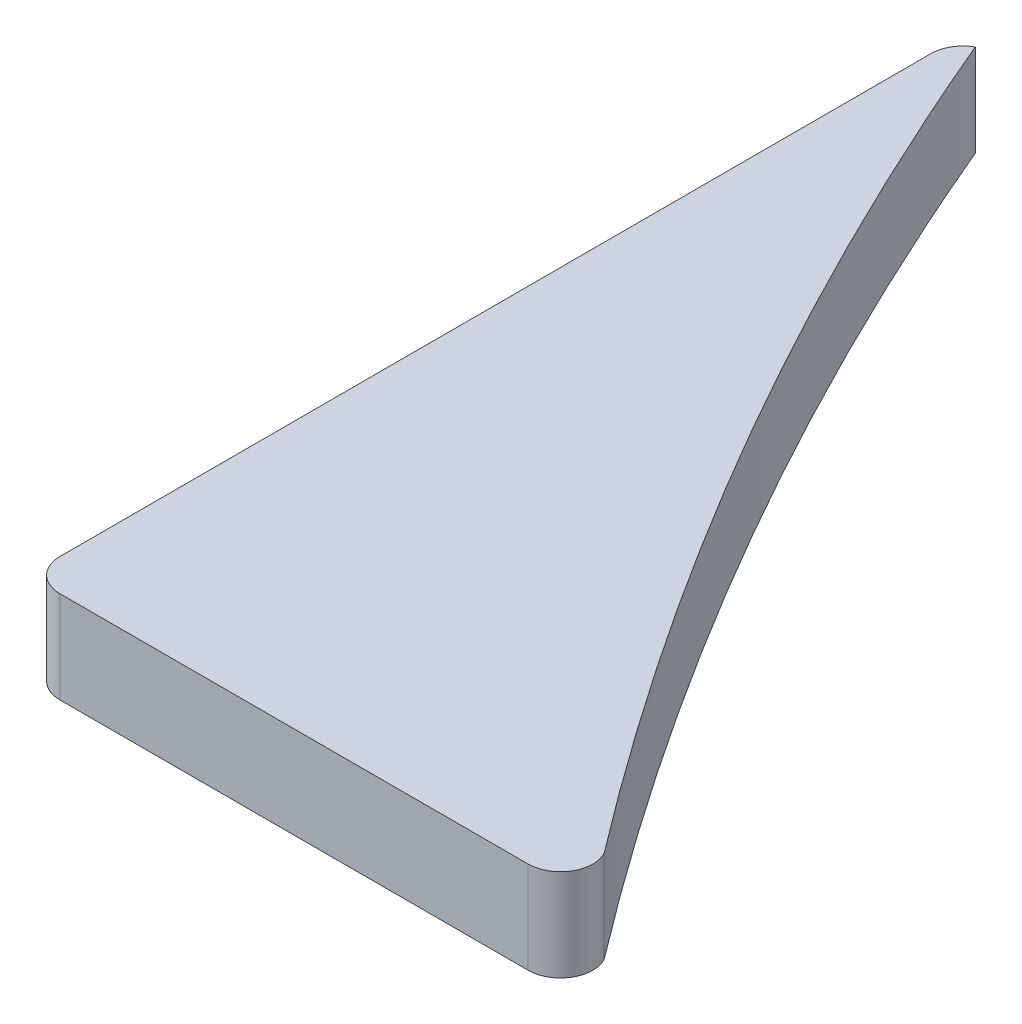
ISO-10303-21;
HEADER;
FILE_DESCRIPTION(('STEP AP214'),'2;1');
FILE_NAME('part.step','',(''),(''),'','','');
FILE_SCHEMA(('AUTOMOTIVE_DESIGN { 1 0 10303 214 1 1 1 1 }'));
ENDSEC;
DATA;
#1=APPLICATION_CONTEXT('core data for automotive mechanical design processes');
#2=APPLICATION_PROTOCOL_DEFINITION('international standard','automotive_design',2000,#1);
#3=PRODUCT_CONTEXT('',#1,'mechanical');
#4=PRODUCT('Part','Part','',(#3));
#5=PRODUCT_RELATED_PRODUCT_CATEGORY('part','',(#4));
#6=PRODUCT_DEFINITION_FORMATION('','',#4);
#7=PRODUCT_DEFINITION_CONTEXT('part definition',#1,'design');
#8=PRODUCT_DEFINITION('design','',#6,#7);
#9=PRODUCT_DEFINITION_SHAPE('','',#8);
#10=(LENGTH_UNIT() NAMED_UNIT(*) SI_UNIT(.MILLI.,.METRE.));
#11=(NAMED_UNIT(*) PLANE_ANGLE_UNIT() SI_UNIT($,.RADIAN.));
#12=(NAMED_UNIT(*) SI_UNIT($,.STERADIAN.) SOLID_ANGLE_UNIT());
#13=UNCERTAINTY_MEASURE_WITH_UNIT(LENGTH_MEASURE(1.E-05),#10,'distance_accuracy_value','');
#14=(GEOMETRIC_REPRESENTATION_CONTEXT(3) GLOBAL_UNCERTAINTY_ASSIGNED_CONTEXT((#13)) GLOBAL_UNIT_ASSIGNED_CONTEXT((#10,
#11,#12)) REPRESENTATION_CONTEXT('',''));
#15=CARTESIAN_POINT('',(0.,0.,0.));
#16=DIRECTION('',(0.,0.,1.));
#17=DIRECTION('',(1.,0.,0.));
#18=AXIS2_PLACEMENT_3D('',#15,#16,#17);
#19=CARTESIAN_POINT('',(2.,5.7,-2.));
#20=DIRECTION('',(0.,-1.,0.));
#21=DIRECTION('',(0.,0.,-1.));
#22=AXIS2_PLACEMENT_3D('',#19,#20,#21);
#23=CYLINDRICAL_SURFACE('',#22,2.);
#24=CARTESIAN_POINT('',(2.,0.,-2.));
#25=DIRECTION('',(0.,1.,0.));
#26=DIRECTION('',(0.,0.,1.));
#27=AXIS2_PLACEMENT_3D('',#24,#25,#26);
#28=CIRCLE('',#27,2.);
#29=CARTESIAN_POINT('',(0.,0.,-2.00000000000001));
#30=VERTEX_POINT('',#29);
#31=CARTESIAN_POINT('',(2.00000000000001,0.,0.));
#32=VERTEX_POINT('',#31);
#33=EDGE_CURVE('E135',#30,#32,#28,.T.);
#34=ORIENTED_EDGE('',*,*,#33,.T.);
#35=DIRECTION('',(0.,-1.,0.));
#36=VECTOR('',#35,1.);
#37=CARTESIAN_POINT('',(2.00000000000001,5.7,0.));
#38=LINE('',#37,#36);
#39=CARTESIAN_POINT('',(2.00000000000001,5.7,0.));
#40=VERTEX_POINT('',#39);
#41=EDGE_CURVE('E11',#40,#32,#38,.T.);
#42=ORIENTED_EDGE('',*,*,#41,.F.);
#43=CARTESIAN_POINT('',(2.,5.7,-2.));
#44=DIRECTION('',(0.,1.,0.));
#45=DIRECTION('',(0.,0.,1.));
#46=AXIS2_PLACEMENT_3D('',#43,#44,#45);
#47=CIRCLE('',#46,2.);
#48=CARTESIAN_POINT('',(0.,5.7,-2.00000000000001));
#49=VERTEX_POINT('',#48);
#50=EDGE_CURVE('E156',#49,#40,#47,.T.);
#51=ORIENTED_EDGE('',*,*,#50,.F.);
#52=DIRECTION('',(0.,-1.,0.));
#53=VECTOR('',#52,1.);
#54=CARTESIAN_POINT('',(0.,5.7,-2.00000000000001));
#55=LINE('',#54,#53);
#56=EDGE_CURVE('E128',#49,#30,#55,.T.);
#57=ORIENTED_EDGE('',*,*,#56,.T.);
#58=EDGE_LOOP('',(#34,#42,#51,#57));
#59=FACE_BOUND('',#58,.T.);
#60=ADVANCED_FACE('F43',(#59),#23,.T.);
#61=CARTESIAN_POINT('',(31.,5.7,0.));
#62=DIRECTION('',(0.,0.,-1.));
#63=DIRECTION('',(-1.,0.,0.));
#64=AXIS2_PLACEMENT_3D('',#61,#62,#63);
#65=PLANE('',#64);
#66=DIRECTION('',(1.,0.,0.));
#67=VECTOR('',#66,1.);
#68=CARTESIAN_POINT('',(31.,0.,0.));
#69=LINE('',#68,#67);
#70=CARTESIAN_POINT('',(31.,0.,0.));
#71=VERTEX_POINT('',#70);
#72=EDGE_CURVE('E139',#32,#71,#69,.T.);
#73=ORIENTED_EDGE('',*,*,#72,.T.);
#74=DIRECTION('',(0.,-1.,0.));
#75=VECTOR('',#74,1.);
#76=CARTESIAN_POINT('',(31.,5.7,0.));
#77=LINE('',#76,#75);
#78=CARTESIAN_POINT('',(31.,5.7,0.));
#79=VERTEX_POINT('',#78);
#80=EDGE_CURVE('E52',#79,#71,#77,.T.);
#81=ORIENTED_EDGE('',*,*,#80,.F.);
#82=DIRECTION('',(1.,0.,0.));
#83=VECTOR('',#82,1.);
#84=CARTESIAN_POINT('',(31.,5.7,0.));
#85=LINE('',#84,#83);
#86=EDGE_CURVE('E97',#40,#79,#85,.T.);
#87=ORIENTED_EDGE('',*,*,#86,.F.);
#88=ORIENTED_EDGE('',*,*,#41,.T.);
#89=EDGE_LOOP('',(#73,#81,#87,#88));
#90=FACE_BOUND('',#89,.T.);
#91=ADVANCED_FACE('F184',(#90),#65,.F.);
#92=CARTESIAN_POINT('',(31.,5.7,-2.));
#93=DIRECTION('',(0.,-1.,0.));
#94=DIRECTION('',(0.,0.,-1.));
#95=AXIS2_PLACEMENT_3D('',#92,#93,#94);
#96=CYLINDRICAL_SURFACE('',#95,2.);
#97=CARTESIAN_POINT('',(31.,0.,-2.));
#98=DIRECTION('',(0.,1.,0.));
#99=DIRECTION('',(0.,0.,-1.));
#100=AXIS2_PLACEMENT_3D('',#97,#98,#99);
#101=CIRCLE('',#100,2.);
#102=CARTESIAN_POINT('',(32.7621915755491,0.,-2.94587570592749));
#103=VERTEX_POINT('',#102);
#104=EDGE_CURVE('E142',#71,#103,#101,.T.);
#105=ORIENTED_EDGE('',*,*,#104,.T.);
#106=DIRECTION('',(0.,-1.,0.));
#107=VECTOR('',#106,1.);
#108=CARTESIAN_POINT('',(32.7621915755491,5.7,-2.94587570592749));
#109=LINE('',#108,#107);
#110=CARTESIAN_POINT('',(32.7621915755491,5.7,-2.94587570592749));
#111=VERTEX_POINT('',#110);
#112=EDGE_CURVE('E121',#111,#103,#109,.T.);
#113=ORIENTED_EDGE('',*,*,#112,.F.);
#114=CARTESIAN_POINT('',(31.,5.7,-2.));
#115=DIRECTION('',(0.,1.,0.));
#116=DIRECTION('',(0.,0.,-1.));
#117=AXIS2_PLACEMENT_3D('',#114,#115,#116);
#118=CIRCLE('',#117,2.);
#119=EDGE_CURVE('E110',#79,#111,#118,.T.);
#120=ORIENTED_EDGE('',*,*,#119,.F.);
#121=ORIENTED_EDGE('',*,*,#80,.T.);
#122=EDGE_LOOP('',(#105,#113,#120,#121));
#123=FACE_BOUND('',#122,.T.);
#124=ADVANCED_FACE('F166',(#123),#96,.T.);
#125=CARTESIAN_POINT('',(32.7621915755491,5.7,-2.94587570592749));
#126=CARTESIAN_POINT('',(13.3909370227549,5.7,-28.4129049767327));
#127=CARTESIAN_POINT('',(1.01618685192367,5.7,-57.6772810110356));
#128=B_SPLINE_CURVE_WITH_KNOTS('',2,(#125,#126,#127),.UNSPECIFIED.,.F.,.F.,(3,3),(0.,1.),.UNSPECIFIED.);
#129=DIRECTION('',(0.,-1.,0.));
#130=VECTOR('',#129,1.);
#131=SURFACE_OF_LINEAR_EXTRUSION('',#128,#130);
#132=CARTESIAN_POINT('',(32.7621915755491,0.,-2.94587570592749));
#133=CARTESIAN_POINT('',(13.3909370227549,0.,-28.4129049767327));
#134=CARTESIAN_POINT('',(1.01618685192367,0.,-57.6772810110356));
#135=B_SPLINE_CURVE_WITH_KNOTS('',2,(#132,#133,#134),.UNSPECIFIED.,.F.,.F.,(3,3),(0.,1.),.UNSPECIFIED.);
#136=CARTESIAN_POINT('',(1.01618685192367,0.,-57.6772810110356));
#137=VERTEX_POINT('',#136);
#138=EDGE_CURVE('E119',#103,#137,#135,.T.);
#139=ORIENTED_EDGE('',*,*,#138,.T.);
#140=DIRECTION('',(0.,-1.,0.));
#141=VECTOR('',#140,1.);
#142=CARTESIAN_POINT('',(1.01618685192367,5.7,-57.6772810110356));
#143=LINE('',#142,#141);
#144=CARTESIAN_POINT('',(1.01618685192367,5.7,-57.6772810110356));
#145=VERTEX_POINT('',#144);
#146=EDGE_CURVE('E116',#145,#137,#143,.T.);
#147=ORIENTED_EDGE('',*,*,#146,.F.);
#148=EDGE_CURVE('E104',#111,#145,#128,.T.);
#149=ORIENTED_EDGE('',*,*,#148,.F.);
#150=ORIENTED_EDGE('',*,*,#112,.T.);
#151=EDGE_LOOP('',(#139,#147,#149,#150));
#152=FACE_BOUND('',#151,.T.);
#153=ADVANCED_FACE('F117',(#152),#131,.F.);
#154=CARTESIAN_POINT('',(2.,5.7,-55.9359850311195));
#155=DIRECTION('',(0.,-1.,0.));
#156=DIRECTION('',(0.,0.,-1.));
#157=AXIS2_PLACEMENT_3D('',#154,#155,#156);
#158=CYLINDRICAL_SURFACE('',#157,2.);
#159=CARTESIAN_POINT('',(2.,0.,-55.9359850311195));
#160=DIRECTION('',(0.,1.,0.));
#161=DIRECTION('',(0.,0.,-1.));
#162=AXIS2_PLACEMENT_3D('',#159,#160,#161);
#163=CIRCLE('',#162,2.);
#164=CARTESIAN_POINT('',(0.,0.,-55.9359850311195));
#165=VERTEX_POINT('',#164);
#166=EDGE_CURVE('E83',#137,#165,#163,.T.);
#167=ORIENTED_EDGE('',*,*,#166,.T.);
#168=DIRECTION('',(0.,-1.,0.));
#169=VECTOR('',#168,1.);
#170=CARTESIAN_POINT('',(0.,5.7,-55.9359850311195));
#171=LINE('',#170,#169);
#172=CARTESIAN_POINT('',(0.,5.7,-55.9359850311195));
#173=VERTEX_POINT('',#172);
#174=EDGE_CURVE('E122',#173,#165,#171,.T.);
#175=ORIENTED_EDGE('',*,*,#174,.F.);
#176=CARTESIAN_POINT('',(2.,5.7,-55.9359850311195));
#177=DIRECTION('',(0.,1.,0.));
#178=DIRECTION('',(0.,0.,-1.));
#179=AXIS2_PLACEMENT_3D('',#176,#177,#178);
#180=CIRCLE('',#179,2.);
#181=EDGE_CURVE('E108',#145,#173,#180,.T.);
#182=ORIENTED_EDGE('',*,*,#181,.F.);
#183=ORIENTED_EDGE('',*,*,#146,.T.);
#184=EDGE_LOOP('',(#167,#175,#182,#183));
#185=FACE_BOUND('',#184,.T.);
#186=ADVANCED_FACE('F124',(#185),#158,.T.);
#187=CARTESIAN_POINT('',(0.,5.7,-2.00000000000001));
#188=DIRECTION('',(1.,0.,0.));
#189=DIRECTION('',(0.,0.,-1.));
#190=AXIS2_PLACEMENT_3D('',#187,#188,#189);
#191=PLANE('',#190);
#192=DIRECTION('',(0.,0.,1.));
#193=VECTOR('',#192,1.);
#194=CARTESIAN_POINT('',(0.,0.,-2.00000000000001));
#195=LINE('',#194,#193);
#196=EDGE_CURVE('E89',#165,#30,#195,.T.);
#197=ORIENTED_EDGE('',*,*,#196,.T.);
#198=ORIENTED_EDGE('',*,*,#56,.F.);
#199=DIRECTION('',(0.,0.,1.));
#200=VECTOR('',#199,1.);
#201=CARTESIAN_POINT('',(0.,5.7,-2.00000000000001));
#202=LINE('',#201,#200);
#203=EDGE_CURVE('E60',#173,#49,#202,.T.);
#204=ORIENTED_EDGE('',*,*,#203,.F.);
#205=ORIENTED_EDGE('',*,*,#174,.T.);
#206=EDGE_LOOP('',(#197,#198,#204,#205));
#207=FACE_BOUND('',#206,.T.);
#208=ADVANCED_FACE('F173',(#207),#191,.F.);
#209=CARTESIAN_POINT('',(2.,5.7,-2.));
#210=DIRECTION('',(0.,1.,0.));
#211=DIRECTION('',(0.,0.,1.));
#212=AXIS2_PLACEMENT_3D('',#209,#210,#211);
#213=PLANE('',#212);
#214=ORIENTED_EDGE('',*,*,#50,.T.);
#215=ORIENTED_EDGE('',*,*,#86,.T.);
#216=ORIENTED_EDGE('',*,*,#119,.T.);
#217=ORIENTED_EDGE('',*,*,#148,.T.);
#218=ORIENTED_EDGE('',*,*,#181,.T.);
#219=ORIENTED_EDGE('',*,*,#203,.T.);
#220=EDGE_LOOP('',(#214,#215,#216,#217,#218,#219));
#221=FACE_BOUND('',#220,.T.);
#222=ADVANCED_FACE('F106',(#221),#213,.T.);
#223=CARTESIAN_POINT('',(2.,0.,-2.));
#224=DIRECTION('',(0.,1.,0.));
#225=DIRECTION('',(0.,0.,1.));
#226=AXIS2_PLACEMENT_3D('',#223,#224,#225);
#227=PLANE('',#226);
#228=ORIENTED_EDGE('',*,*,#33,.F.);
#229=ORIENTED_EDGE('',*,*,#196,.F.);
#230=ORIENTED_EDGE('',*,*,#166,.F.);
#231=ORIENTED_EDGE('',*,*,#138,.F.);
#232=ORIENTED_EDGE('',*,*,#104,.F.);
#233=ORIENTED_EDGE('',*,*,#72,.F.);
#234=EDGE_LOOP('',(#228,#229,#230,#231,#232,#233));
#235=FACE_BOUND('',#234,.T.);
#236=ADVANCED_FACE('F169',(#235),#227,.F.);
#237=CLOSED_SHELL('',(#60,#91,#124,#153,#186,#208,#222,#236));
#238=MANIFOLD_SOLID_BREP('B2',#237);
#239=ADVANCED_BREP_SHAPE_REPRESENTATION('',(#18,#238),#14);
#240=SHAPE_DEFINITION_REPRESENTATION(#9,#239);
ENDSEC;
END-ISO-10303-21;
